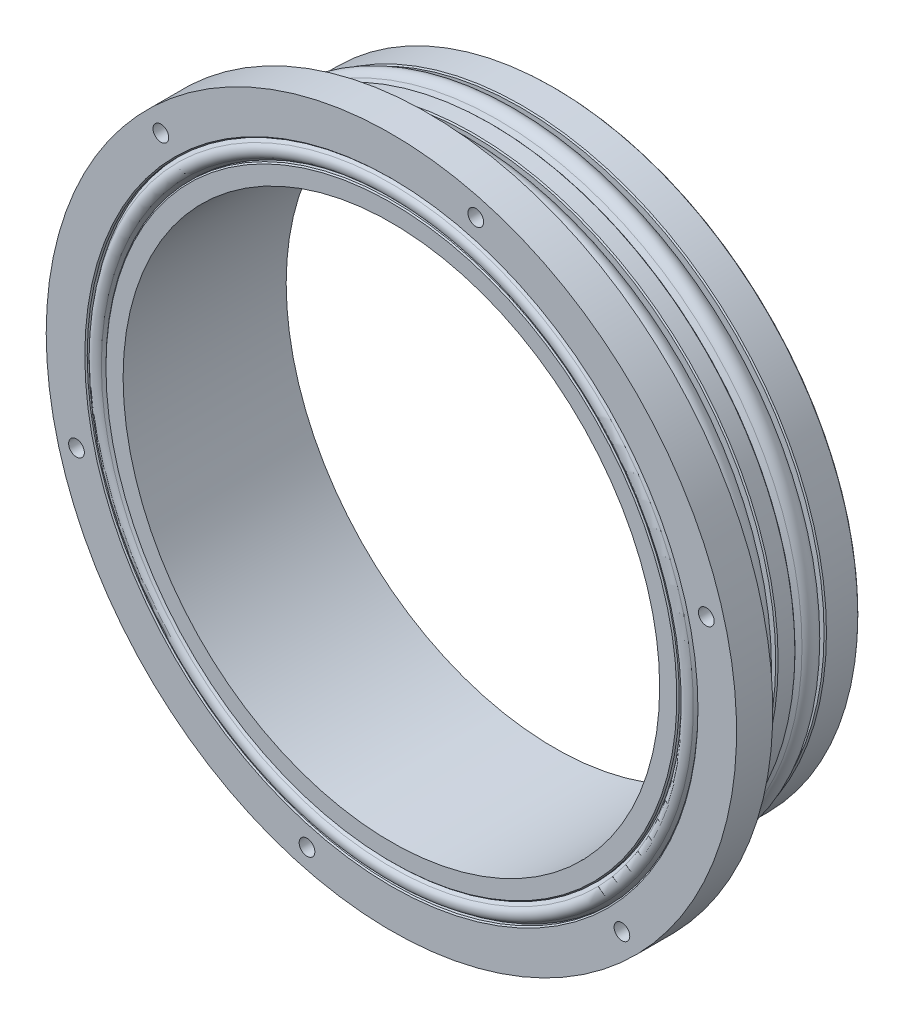
ISO-10303-21;
HEADER;
FILE_DESCRIPTION(('STEP AP214'),'2;1');
FILE_NAME('part.step','',(''),(''),'','','');
FILE_SCHEMA(('AUTOMOTIVE_DESIGN { 1 0 10303 214 1 1 1 1 }'));
ENDSEC;
DATA;
#1=APPLICATION_CONTEXT('core data for automotive mechanical design processes');
#2=APPLICATION_PROTOCOL_DEFINITION('international standard','automotive_design',2000,#1);
#3=PRODUCT_CONTEXT('',#1,'mechanical');
#4=PRODUCT('Part','Part','',(#3));
#5=PRODUCT_RELATED_PRODUCT_CATEGORY('part','',(#4));
#6=PRODUCT_DEFINITION_FORMATION('','',#4);
#7=PRODUCT_DEFINITION_CONTEXT('part definition',#1,'design');
#8=PRODUCT_DEFINITION('design','',#6,#7);
#9=PRODUCT_DEFINITION_SHAPE('','',#8);
#10=(LENGTH_UNIT() NAMED_UNIT(*) SI_UNIT(.MILLI.,.METRE.));
#11=(NAMED_UNIT(*) PLANE_ANGLE_UNIT() SI_UNIT($,.RADIAN.));
#12=(NAMED_UNIT(*) SI_UNIT($,.STERADIAN.) SOLID_ANGLE_UNIT());
#13=UNCERTAINTY_MEASURE_WITH_UNIT(LENGTH_MEASURE(1.E-05),#10,'distance_accuracy_value','');
#14=(GEOMETRIC_REPRESENTATION_CONTEXT(3) GLOBAL_UNCERTAINTY_ASSIGNED_CONTEXT((#13)) GLOBAL_UNIT_ASSIGNED_CONTEXT((#10,
#11,#12)) REPRESENTATION_CONTEXT('',''));
#15=CARTESIAN_POINT('',(0.,0.,0.));
#16=DIRECTION('',(0.,0.,1.));
#17=DIRECTION('',(1.,0.,0.));
#18=AXIS2_PLACEMENT_3D('',#15,#16,#17);
#19=CARTESIAN_POINT('',(0.,0.,0.));
#20=DIRECTION('',(0.,0.,-1.));
#21=DIRECTION('',(-1.,0.,0.));
#22=AXIS2_PLACEMENT_3D('',#19,#20,#21);
#23=PLANE('',#22);
#24=CARTESIAN_POINT('',(0.,0.,0.));
#25=DIRECTION('',(0.,0.,-1.));
#26=DIRECTION('',(-1.,0.,0.));
#27=AXIS2_PLACEMENT_3D('',#24,#25,#26);
#28=CIRCLE('',#27,50.219);
#29=CARTESIAN_POINT('',(-50.219,0.,0.));
#30=VERTEX_POINT('',#29);
#31=EDGE_CURVE('E50',#30,#30,#28,.T.);
#32=ORIENTED_EDGE('',*,*,#31,.T.);
#33=EDGE_LOOP('',(#32));
#34=FACE_BOUND('',#33,.T.);
#35=CARTESIAN_POINT('',(33.2269476479559,-33.2269476479558,0.));
#36=DIRECTION('',(0.,0.,-1.));
#37=DIRECTION('',(0.,1.,0.));
#38=AXIS2_PLACEMENT_3D('',#35,#36,#37);
#39=CIRCLE('',#38,1.29999999999999);
#40=CARTESIAN_POINT('',(33.2269476479559,-31.9269476479559,0.));
#41=VERTEX_POINT('',#40);
#42=EDGE_CURVE('E133',#41,#41,#39,.T.);
#43=ORIENTED_EDGE('',*,*,#42,.F.);
#44=EDGE_LOOP('',(#43));
#45=FACE_BOUND('',#44,.T.);
#46=CARTESIAN_POINT('',(-33.2269476479558,-33.2269476479559,0.));
#47=DIRECTION('',(0.,0.,-1.));
#48=DIRECTION('',(0.,1.,0.));
#49=AXIS2_PLACEMENT_3D('',#46,#47,#48);
#50=CIRCLE('',#49,1.29999999999999);
#51=CARTESIAN_POINT('',(-33.2269476479558,-31.9269476479559,0.));
#52=VERTEX_POINT('',#51);
#53=EDGE_CURVE('E139',#52,#52,#50,.T.);
#54=ORIENTED_EDGE('',*,*,#53,.F.);
#55=EDGE_LOOP('',(#54));
#56=FACE_BOUND('',#55,.T.);
#57=CARTESIAN_POINT('',(-33.2269476479559,33.2269476479558,0.));
#58=DIRECTION('',(0.,0.,-1.));
#59=DIRECTION('',(0.,1.,0.));
#60=AXIS2_PLACEMENT_3D('',#57,#58,#59);
#61=CIRCLE('',#60,1.29999999999999);
#62=CARTESIAN_POINT('',(-33.2269476479559,34.5269476479558,0.));
#63=VERTEX_POINT('',#62);
#64=EDGE_CURVE('E145',#63,#63,#61,.T.);
#65=ORIENTED_EDGE('',*,*,#64,.F.);
#66=EDGE_LOOP('',(#65));
#67=FACE_BOUND('',#66,.T.);
#68=CARTESIAN_POINT('',(33.2269476479558,33.2269476479559,0.));
#69=DIRECTION('',(0.,0.,-1.));
#70=DIRECTION('',(0.,1.,0.));
#71=AXIS2_PLACEMENT_3D('',#68,#69,#70);
#72=CIRCLE('',#71,1.29999999999999);
#73=CARTESIAN_POINT('',(33.2269476479558,34.5269476479559,0.));
#74=VERTEX_POINT('',#73);
#75=EDGE_CURVE('E151',#74,#74,#72,.T.);
#76=ORIENTED_EDGE('',*,*,#75,.F.);
#77=EDGE_LOOP('',(#76));
#78=FACE_BOUND('',#77,.T.);
#79=CARTESIAN_POINT('',(0.,0.,0.));
#80=DIRECTION('',(0.,0.,1.));
#81=DIRECTION('',(1.,0.,0.));
#82=AXIS2_PLACEMENT_3D('',#79,#80,#81);
#83=CIRCLE('',#82,44.419);
#84=CARTESIAN_POINT('',(44.419,0.,0.));
#85=VERTEX_POINT('',#84);
#86=EDGE_CURVE('E185',#85,#85,#83,.T.);
#87=ORIENTED_EDGE('',*,*,#86,.T.);
#88=EDGE_LOOP('',(#87));
#89=FACE_BOUND('',#88,.T.);
#90=ADVANCED_FACE('F30',(#34,#45,#56,#67,#78,#89),#23,.T.);
#91=CARTESIAN_POINT('',(0.,0.,26.8));
#92=DIRECTION('',(0.,0.,-1.));
#93=DIRECTION('',(-1.,0.,0.));
#94=AXIS2_PLACEMENT_3D('',#91,#92,#93);
#95=CONICAL_SURFACE('',#94,47.4599,0.785398163397405);
#96=CARTESIAN_POINT('',(0.,0.,27.));
#97=DIRECTION('',(0.,0.,-1.));
#98=DIRECTION('',(-1.,0.,0.));
#99=AXIS2_PLACEMENT_3D('',#96,#97,#98);
#100=CIRCLE('',#99,47.2599);
#101=CARTESIAN_POINT('',(-47.2599,0.,27.));
#102=VERTEX_POINT('',#101);
#103=EDGE_CURVE('E127',#102,#102,#100,.T.);
#104=ORIENTED_EDGE('',*,*,#103,.T.);
#105=EDGE_LOOP('',(#104));
#106=FACE_BOUND('',#105,.T.);
#107=CARTESIAN_POINT('',(0.,0.,26.8));
#108=DIRECTION('',(0.,0.,-1.));
#109=DIRECTION('',(-1.,0.,0.));
#110=AXIS2_PLACEMENT_3D('',#107,#108,#109);
#111=CIRCLE('',#110,47.4599);
#112=CARTESIAN_POINT('',(-47.4599,0.,26.8));
#113=VERTEX_POINT('',#112);
#114=EDGE_CURVE('E74',#113,#113,#111,.T.);
#115=ORIENTED_EDGE('',*,*,#114,.F.);
#116=EDGE_LOOP('',(#115));
#117=FACE_BOUND('',#116,.T.);
#118=ADVANCED_FACE('F202',(#106,#117),#95,.T.);
#119=CARTESIAN_POINT('',(0.,0.,27.5266928789603));
#120=DIRECTION('',(0.,0.,-1.));
#121=DIRECTION('',(-1.,0.,0.));
#122=AXIS2_PLACEMENT_3D('',#119,#120,#121);
#123=CYLINDRICAL_SURFACE('',#122,47.4599);
#124=ORIENTED_EDGE('',*,*,#114,.T.);
#125=EDGE_LOOP('',(#124));
#126=FACE_BOUND('',#125,.T.);
#127=CARTESIAN_POINT('',(0.,0.,26.2791702351356));
#128=DIRECTION('',(0.,0.,-1.));
#129=DIRECTION('',(-1.,0.,0.));
#130=AXIS2_PLACEMENT_3D('',#127,#128,#129);
#131=CIRCLE('',#130,47.4599);
#132=CARTESIAN_POINT('',(-47.4599,0.,26.2791702351356));
#133=VERTEX_POINT('',#132);
#134=EDGE_CURVE('E82',#133,#133,#131,.T.);
#135=ORIENTED_EDGE('',*,*,#134,.F.);
#136=EDGE_LOOP('',(#135));
#137=FACE_BOUND('',#136,.T.);
#138=ADVANCED_FACE('F205',(#126,#137),#123,.T.);
#139=CARTESIAN_POINT('',(0.,0.,27.0190146200091));
#140=DIRECTION('',(0.,0.,1.));
#141=DIRECTION('',(1.,0.,0.));
#142=AXIS2_PLACEMENT_3D('',#139,#140,#141);
#143=CONICAL_SURFACE('',#142,48.0048384362623,0.63484269657211);
#144=ORIENTED_EDGE('',*,*,#134,.T.);
#145=EDGE_LOOP('',(#144));
#146=FACE_BOUND('',#145,.T.);
#147=CARTESIAN_POINT('',(0.,0.,27.0190146200091));
#148=DIRECTION('',(0.,0.,-1.));
#149=DIRECTION('',(-1.,0.,0.));
#150=AXIS2_PLACEMENT_3D('',#147,#148,#149);
#151=CIRCLE('',#150,48.0048384362623);
#152=CARTESIAN_POINT('',(-48.0048384362623,0.,27.0190146200091));
#153=VERTEX_POINT('',#152);
#154=EDGE_CURVE('E85',#153,#153,#151,.T.);
#155=ORIENTED_EDGE('',*,*,#154,.F.);
#156=EDGE_LOOP('',(#155));
#157=FACE_BOUND('',#156,.T.);
#158=ADVANCED_FACE('F211',(#146,#157),#143,.F.);
#159=CARTESIAN_POINT('',(0.,0.,26.2791702351357));
#160=DIRECTION('',(0.,0.,-1.));
#161=DIRECTION('',(-1.,0.,0.));
#162=AXIS2_PLACEMENT_3D('',#159,#160,#161);
#163=TOROIDAL_SURFACE('',#162,49.0093,1.24752264382461);
#164=ORIENTED_EDGE('',*,*,#154,.T.);
#165=EDGE_LOOP('',(#164));
#166=FACE_BOUND('',#165,.T.);
#167=CARTESIAN_POINT('',(0.,0.,27.0190146200091));
#168=DIRECTION('',(0.,0.,-1.));
#169=DIRECTION('',(-1.,0.,0.));
#170=AXIS2_PLACEMENT_3D('',#167,#168,#169);
#171=CIRCLE('',#170,50.0137615637377);
#172=CARTESIAN_POINT('',(-50.0137615637377,0.,27.0190146200091));
#173=VERTEX_POINT('',#172);
#174=EDGE_CURVE('E88',#173,#173,#171,.T.);
#175=ORIENTED_EDGE('',*,*,#174,.F.);
#176=EDGE_LOOP('',(#175));
#177=FACE_BOUND('',#176,.T.);
#178=ADVANCED_FACE('F217',(#166,#177),#163,.T.);
#179=CARTESIAN_POINT('',(0.,0.,26.2791702351356));
#180=DIRECTION('',(0.,0.,-1.));
#181=DIRECTION('',(-1.,0.,0.));
#182=AXIS2_PLACEMENT_3D('',#179,#180,#181);
#183=CONICAL_SURFACE('',#182,50.5587,0.6348426965721);
#184=ORIENTED_EDGE('',*,*,#174,.T.);
#185=EDGE_LOOP('',(#184));
#186=FACE_BOUND('',#185,.T.);
#187=CARTESIAN_POINT('',(0.,0.,26.2791702351356));
#188=DIRECTION('',(0.,0.,-1.));
#189=DIRECTION('',(-1.,0.,0.));
#190=AXIS2_PLACEMENT_3D('',#187,#188,#189);
#191=CIRCLE('',#190,50.5587);
#192=CARTESIAN_POINT('',(-50.5587,0.,26.2791702351356));
#193=VERTEX_POINT('',#192);
#194=EDGE_CURVE('E91',#193,#193,#191,.T.);
#195=ORIENTED_EDGE('',*,*,#194,.F.);
#196=EDGE_LOOP('',(#195));
#197=FACE_BOUND('',#196,.T.);
#198=ADVANCED_FACE('F223',(#186,#197),#183,.T.);
#199=CARTESIAN_POINT('',(0.,0.,27.5266928789603));
#200=DIRECTION('',(0.,0.,-1.));
#201=DIRECTION('',(-1.,0.,0.));
#202=AXIS2_PLACEMENT_3D('',#199,#200,#201);
#203=CYLINDRICAL_SURFACE('',#202,50.5587);
#204=CARTESIAN_POINT('',(0.,0.,26.8));
#205=DIRECTION('',(0.,0.,1.));
#206=DIRECTION('',(1.,0.,0.));
#207=AXIS2_PLACEMENT_3D('',#204,#205,#206);
#208=CIRCLE('',#207,50.5587);
#209=CARTESIAN_POINT('',(50.5587,0.,26.8));
#210=VERTEX_POINT('',#209);
#211=EDGE_CURVE('E41',#210,#210,#208,.T.);
#212=ORIENTED_EDGE('',*,*,#211,.T.);
#213=EDGE_LOOP('',(#212));
#214=FACE_BOUND('',#213,.T.);
#215=ORIENTED_EDGE('',*,*,#194,.T.);
#216=EDGE_LOOP('',(#215));
#217=FACE_BOUND('',#216,.T.);
#218=ADVANCED_FACE('F229',(#214,#217),#203,.F.);
#219=CARTESIAN_POINT('',(57.15,0.,27.));
#220=DIRECTION('',(0.,0.,1.));
#221=DIRECTION('',(1.,0.,0.));
#222=AXIS2_PLACEMENT_3D('',#219,#220,#221);
#223=PLANE('',#222);
#224=CARTESIAN_POINT('',(0.,0.,27.));
#225=DIRECTION('',(0.,0.,1.));
#226=DIRECTION('',(1.,0.,0.));
#227=AXIS2_PLACEMENT_3D('',#224,#225,#226);
#228=CIRCLE('',#227,50.7587);
#229=CARTESIAN_POINT('',(50.7587,0.,27.));
#230=VERTEX_POINT('',#229);
#231=EDGE_CURVE('E45',#230,#230,#228,.F.);
#232=ORIENTED_EDGE('',*,*,#231,.T.);
#233=EDGE_LOOP('',(#232));
#234=FACE_BOUND('',#233,.T.);
#235=CARTESIAN_POINT('',(-38.166088514544,38.1660885145439,27.));
#236=DIRECTION('',(0.,0.,1.));
#237=DIRECTION('',(1.,0.,0.));
#238=AXIS2_PLACEMENT_3D('',#235,#236,#237);
#239=CIRCLE('',#238,1.29999999999999);
#240=CARTESIAN_POINT('',(-36.866088514544,38.1660885145439,27.));
#241=VERTEX_POINT('',#240);
#242=EDGE_CURVE('E179',#241,#241,#239,.T.);
#243=ORIENTED_EDGE('',*,*,#242,.F.);
#244=EDGE_LOOP('',(#243));
#245=FACE_BOUND('',#244,.T.);
#246=CARTESIAN_POINT('',(13.9697579594085,52.1358464739525,27.));
#247=DIRECTION('',(0.,0.,1.));
#248=DIRECTION('',(1.,0.,0.));
#249=AXIS2_PLACEMENT_3D('',#246,#247,#248);
#250=CIRCLE('',#249,1.29999999999999);
#251=CARTESIAN_POINT('',(15.2697579594085,52.1358464739525,27.));
#252=VERTEX_POINT('',#251);
#253=EDGE_CURVE('E173',#252,#252,#250,.T.);
#254=ORIENTED_EDGE('',*,*,#253,.F.);
#255=EDGE_LOOP('',(#254));
#256=FACE_BOUND('',#255,.T.);
#257=CARTESIAN_POINT('',(52.1358464739525,13.9697579594086,27.));
#258=DIRECTION('',(0.,0.,1.));
#259=DIRECTION('',(1.,0.,0.));
#260=AXIS2_PLACEMENT_3D('',#257,#258,#259);
#261=CIRCLE('',#260,1.29999999999999);
#262=CARTESIAN_POINT('',(53.4358464739525,13.9697579594086,27.));
#263=VERTEX_POINT('',#262);
#264=EDGE_CURVE('E167',#263,#263,#261,.T.);
#265=ORIENTED_EDGE('',*,*,#264,.F.);
#266=EDGE_LOOP('',(#265));
#267=FACE_BOUND('',#266,.T.);
#268=CARTESIAN_POINT('',(38.166088514544,-38.1660885145439,27.));
#269=DIRECTION('',(0.,0.,1.));
#270=DIRECTION('',(1.,0.,0.));
#271=AXIS2_PLACEMENT_3D('',#268,#269,#270);
#272=CIRCLE('',#271,1.29999999999999);
#273=CARTESIAN_POINT('',(39.4660885145439,-38.1660885145439,27.));
#274=VERTEX_POINT('',#273);
#275=EDGE_CURVE('E75',#274,#274,#272,.T.);
#276=ORIENTED_EDGE('',*,*,#275,.F.);
#277=EDGE_LOOP('',(#276));
#278=FACE_BOUND('',#277,.T.);
#279=CARTESIAN_POINT('',(-13.9697579594085,-52.1358464739525,27.));
#280=DIRECTION('',(0.,0.,1.));
#281=DIRECTION('',(1.,0.,0.));
#282=AXIS2_PLACEMENT_3D('',#279,#280,#281);
#283=CIRCLE('',#282,1.29999999999999);
#284=CARTESIAN_POINT('',(-12.6697579594085,-52.1358464739525,27.));
#285=VERTEX_POINT('',#284);
#286=EDGE_CURVE('E160',#285,#285,#283,.T.);
#287=ORIENTED_EDGE('',*,*,#286,.F.);
#288=EDGE_LOOP('',(#287));
#289=FACE_BOUND('',#288,.T.);
#290=CARTESIAN_POINT('',(-52.1358464739525,-13.9697579594086,27.));
#291=DIRECTION('',(0.,0.,1.));
#292=DIRECTION('',(1.,0.,0.));
#293=AXIS2_PLACEMENT_3D('',#290,#291,#292);
#294=CIRCLE('',#293,1.29999999999999);
#295=CARTESIAN_POINT('',(-50.8358464739525,-13.9697579594086,27.));
#296=VERTEX_POINT('',#295);
#297=EDGE_CURVE('E154',#296,#296,#294,.T.);
#298=ORIENTED_EDGE('',*,*,#297,.F.);
#299=EDGE_LOOP('',(#298));
#300=FACE_BOUND('',#299,.T.);
#301=CARTESIAN_POINT('',(0.,0.,27.));
#302=DIRECTION('',(0.,0.,-1.));
#303=DIRECTION('',(-1.,0.,0.));
#304=AXIS2_PLACEMENT_3D('',#301,#302,#303);
#305=CIRCLE('',#304,57.15);
#306=CARTESIAN_POINT('',(-57.15,0.,27.));
#307=VERTEX_POINT('',#306);
#308=EDGE_CURVE('E94',#307,#307,#305,.T.);
#309=ORIENTED_EDGE('',*,*,#308,.F.);
#310=EDGE_LOOP('',(#309));
#311=FACE_BOUND('',#310,.T.);
#312=ADVANCED_FACE('F234',(#234,#245,#256,#267,#278,#289,#300,#311),#223,.T.);
#313=CARTESIAN_POINT('',(0.,0.,27.5266928789603));
#314=DIRECTION('',(0.,0.,-1.));
#315=DIRECTION('',(-1.,0.,0.));
#316=AXIS2_PLACEMENT_3D('',#313,#314,#315);
#317=CYLINDRICAL_SURFACE('',#316,57.15);
#318=ORIENTED_EDGE('',*,*,#308,.T.);
#319=EDGE_LOOP('',(#318));
#320=FACE_BOUND('',#319,.T.);
#321=CARTESIAN_POINT('',(0.,0.,21.));
#322=DIRECTION('',(0.,0.,-1.));
#323=DIRECTION('',(-1.,0.,0.));
#324=AXIS2_PLACEMENT_3D('',#321,#322,#323);
#325=CIRCLE('',#324,57.15);
#326=CARTESIAN_POINT('',(-57.15,0.,21.));
#327=VERTEX_POINT('',#326);
#328=EDGE_CURVE('E97',#327,#327,#325,.T.);
#329=ORIENTED_EDGE('',*,*,#328,.F.);
#330=EDGE_LOOP('',(#329));
#331=FACE_BOUND('',#330,.T.);
#332=ADVANCED_FACE('F240',(#320,#331),#317,.T.);
#333=CARTESIAN_POINT('',(50.419,0.,21.));
#334=DIRECTION('',(0.,0.,-1.));
#335=DIRECTION('',(-1.,0.,0.));
#336=AXIS2_PLACEMENT_3D('',#333,#334,#335);
#337=PLANE('',#336);
#338=CARTESIAN_POINT('',(-38.166088514544,38.1660885145439,21.));
#339=DIRECTION('',(0.,0.,-1.));
#340=DIRECTION('',(0.,1.,0.));
#341=AXIS2_PLACEMENT_3D('',#338,#339,#340);
#342=CIRCLE('',#341,1.29999999999999);
#343=CARTESIAN_POINT('',(-38.166088514544,39.4660885145439,21.));
#344=VERTEX_POINT('',#343);
#345=EDGE_CURVE('E182',#344,#344,#342,.T.);
#346=ORIENTED_EDGE('',*,*,#345,.F.);
#347=EDGE_LOOP('',(#346));
#348=FACE_BOUND('',#347,.T.);
#349=CARTESIAN_POINT('',(13.9697579594085,52.1358464739525,21.));
#350=DIRECTION('',(0.,0.,-1.));
#351=DIRECTION('',(0.,1.,0.));
#352=AXIS2_PLACEMENT_3D('',#349,#350,#351);
#353=CIRCLE('',#352,1.29999999999999);
#354=CARTESIAN_POINT('',(13.9697579594085,53.4358464739525,21.));
#355=VERTEX_POINT('',#354);
#356=EDGE_CURVE('E176',#355,#355,#353,.T.);
#357=ORIENTED_EDGE('',*,*,#356,.F.);
#358=EDGE_LOOP('',(#357));
#359=FACE_BOUND('',#358,.T.);
#360=CARTESIAN_POINT('',(52.1358464739525,13.9697579594086,21.));
#361=DIRECTION('',(0.,0.,-1.));
#362=DIRECTION('',(0.,1.,0.));
#363=AXIS2_PLACEMENT_3D('',#360,#361,#362);
#364=CIRCLE('',#363,1.29999999999999);
#365=CARTESIAN_POINT('',(52.1358464739525,15.2697579594086,21.));
#366=VERTEX_POINT('',#365);
#367=EDGE_CURVE('E170',#366,#366,#364,.T.);
#368=ORIENTED_EDGE('',*,*,#367,.F.);
#369=EDGE_LOOP('',(#368));
#370=FACE_BOUND('',#369,.T.);
#371=CARTESIAN_POINT('',(38.166088514544,-38.1660885145439,21.));
#372=DIRECTION('',(0.,0.,-1.));
#373=DIRECTION('',(0.,1.,0.));
#374=AXIS2_PLACEMENT_3D('',#371,#372,#373);
#375=CIRCLE('',#374,1.29999999999999);
#376=CARTESIAN_POINT('',(38.166088514544,-36.8660885145439,21.));
#377=VERTEX_POINT('',#376);
#378=EDGE_CURVE('E79',#377,#377,#375,.T.);
#379=ORIENTED_EDGE('',*,*,#378,.F.);
#380=EDGE_LOOP('',(#379));
#381=FACE_BOUND('',#380,.T.);
#382=CARTESIAN_POINT('',(-13.9697579594085,-52.1358464739525,21.));
#383=DIRECTION('',(0.,0.,-1.));
#384=DIRECTION('',(0.,1.,0.));
#385=AXIS2_PLACEMENT_3D('',#382,#383,#384);
#386=CIRCLE('',#385,1.29999999999999);
#387=CARTESIAN_POINT('',(-13.9697579594085,-50.8358464739525,21.));
#388=VERTEX_POINT('',#387);
#389=EDGE_CURVE('E78',#388,#388,#386,.T.);
#390=ORIENTED_EDGE('',*,*,#389,.F.);
#391=EDGE_LOOP('',(#390));
#392=FACE_BOUND('',#391,.T.);
#393=CARTESIAN_POINT('',(-52.1358464739525,-13.9697579594086,21.));
#394=DIRECTION('',(0.,0.,-1.));
#395=DIRECTION('',(0.,1.,0.));
#396=AXIS2_PLACEMENT_3D('',#393,#394,#395);
#397=CIRCLE('',#396,1.29999999999999);
#398=CARTESIAN_POINT('',(-52.1358464739525,-12.6697579594086,21.));
#399=VERTEX_POINT('',#398);
#400=EDGE_CURVE('E157',#399,#399,#397,.T.);
#401=ORIENTED_EDGE('',*,*,#400,.F.);
#402=EDGE_LOOP('',(#401));
#403=FACE_BOUND('',#402,.T.);
#404=ORIENTED_EDGE('',*,*,#328,.T.);
#405=EDGE_LOOP('',(#404));
#406=FACE_BOUND('',#405,.T.);
#407=CARTESIAN_POINT('',(0.,0.,21.));
#408=DIRECTION('',(0.,0.,-1.));
#409=DIRECTION('',(-1.,0.,0.));
#410=AXIS2_PLACEMENT_3D('',#407,#408,#409);
#411=CIRCLE('',#410,50.419);
#412=CARTESIAN_POINT('',(-50.419,0.,21.));
#413=VERTEX_POINT('',#412);
#414=EDGE_CURVE('E100',#413,#413,#411,.T.);
#415=ORIENTED_EDGE('',*,*,#414,.F.);
#416=EDGE_LOOP('',(#415));
#417=FACE_BOUND('',#416,.T.);
#418=ADVANCED_FACE('F300',(#348,#359,#370,#381,#392,#403,#406,#417),#337,.T.);
#419=CARTESIAN_POINT('',(0.,0.,27.5266928789603));
#420=DIRECTION('',(0.,0.,-1.));
#421=DIRECTION('',(-1.,0.,0.));
#422=AXIS2_PLACEMENT_3D('',#419,#420,#421);
#423=CYLINDRICAL_SURFACE('',#422,50.419);
#424=CARTESIAN_POINT('',(0.,0.,18.6129999999999));
#425=DIRECTION('',(0.,0.,-1.));
#426=DIRECTION('',(-1.,0.,0.));
#427=AXIS2_PLACEMENT_3D('',#424,#425,#426);
#428=CIRCLE('',#427,50.419);
#429=CARTESIAN_POINT('',(-50.419,0.,18.6129999999999));
#430=VERTEX_POINT('',#429);
#431=EDGE_CURVE('E10',#430,#430,#428,.F.);
#432=ORIENTED_EDGE('',*,*,#431,.T.);
#433=EDGE_LOOP('',(#432));
#434=FACE_BOUND('',#433,.T.);
#435=ORIENTED_EDGE('',*,*,#414,.T.);
#436=EDGE_LOOP('',(#435));
#437=FACE_BOUND('',#436,.T.);
#438=ADVANCED_FACE('F297',(#434,#437),#423,.T.);
#439=CARTESIAN_POINT('',(49.04105,0.,18.413));
#440=DIRECTION('',(0.,0.,-1.));
#441=DIRECTION('',(-1.,0.,0.));
#442=AXIS2_PLACEMENT_3D('',#439,#440,#441);
#443=PLANE('',#442);
#444=CARTESIAN_POINT('',(0.,0.,18.413));
#445=DIRECTION('',(0.,0.,-1.));
#446=DIRECTION('',(-1.,0.,0.));
#447=AXIS2_PLACEMENT_3D('',#444,#445,#446);
#448=CIRCLE('',#447,50.219);
#449=CARTESIAN_POINT('',(-50.219,0.,18.413));
#450=VERTEX_POINT('',#449);
#451=EDGE_CURVE('E37',#450,#450,#448,.T.);
#452=ORIENTED_EDGE('',*,*,#451,.T.);
#453=EDGE_LOOP('',(#452));
#454=FACE_BOUND('',#453,.T.);
#455=CARTESIAN_POINT('',(0.,0.,18.413));
#456=DIRECTION('',(0.,0.,-1.));
#457=DIRECTION('',(-1.,0.,0.));
#458=AXIS2_PLACEMENT_3D('',#455,#456,#457);
#459=CIRCLE('',#458,49.04105);
#460=CARTESIAN_POINT('',(-49.04105,0.,18.413));
#461=VERTEX_POINT('',#460);
#462=EDGE_CURVE('E103',#461,#461,#459,.T.);
#463=ORIENTED_EDGE('',*,*,#462,.F.);
#464=EDGE_LOOP('',(#463));
#465=FACE_BOUND('',#464,.T.);
#466=ADVANCED_FACE('F293',(#454,#465),#443,.T.);
#467=CARTESIAN_POINT('',(0.,0.,17.4525046448516));
#468=DIRECTION('',(0.,0.,-1.));
#469=DIRECTION('',(-1.,0.,0.));
#470=AXIS2_PLACEMENT_3D('',#467,#468,#469);
#471=CONICAL_SURFACE('',#470,50.4316518859611,0.966336052037741);
#472=ORIENTED_EDGE('',*,*,#462,.T.);
#473=EDGE_LOOP('',(#472));
#474=FACE_BOUND('',#473,.T.);
#475=CARTESIAN_POINT('',(0.,0.,17.4525046448516));
#476=DIRECTION('',(0.,0.,-1.));
#477=DIRECTION('',(-1.,0.,0.));
#478=AXIS2_PLACEMENT_3D('',#475,#476,#477);
#479=CIRCLE('',#478,50.4316518859611);
#480=CARTESIAN_POINT('',(-50.4316518859611,0.,17.4525046448516));
#481=VERTEX_POINT('',#480);
#482=EDGE_CURVE('E106',#481,#481,#479,.T.);
#483=ORIENTED_EDGE('',*,*,#482,.F.);
#484=EDGE_LOOP('',(#483));
#485=FACE_BOUND('',#484,.T.);
#486=ADVANCED_FACE('F289',(#474,#485),#471,.T.);
#487=CARTESIAN_POINT('',(0.,0.,16.));
#488=DIRECTION('',(0.,0.,-1.));
#489=DIRECTION('',(-1.,0.,0.));
#490=AXIS2_PLACEMENT_3D('',#487,#488,#489);
#491=TOROIDAL_SURFACE('',#490,49.4284,1.76530000000002);
#492=ORIENTED_EDGE('',*,*,#482,.T.);
#493=EDGE_LOOP('',(#492));
#494=FACE_BOUND('',#493,.T.);
#495=CARTESIAN_POINT('',(0.,0.,14.5474953551483));
#496=DIRECTION('',(0.,0.,-1.));
#497=DIRECTION('',(-1.,0.,0.));
#498=AXIS2_PLACEMENT_3D('',#495,#496,#497);
#499=CIRCLE('',#498,50.4316518859611);
#500=CARTESIAN_POINT('',(-50.4316518859611,0.,14.5474953551483));
#501=VERTEX_POINT('',#500);
#502=EDGE_CURVE('E109',#501,#501,#499,.T.);
#503=ORIENTED_EDGE('',*,*,#502,.F.);
#504=EDGE_LOOP('',(#503));
#505=FACE_BOUND('',#504,.T.);
#506=ADVANCED_FACE('F285',(#494,#505),#491,.T.);
#507=CARTESIAN_POINT('',(0.,0.,13.587));
#508=DIRECTION('',(0.,0.,1.));
#509=DIRECTION('',(1.,0.,0.));
#510=AXIS2_PLACEMENT_3D('',#507,#508,#509);
#511=CONICAL_SURFACE('',#510,49.0410500000001,0.966336052037724);
#512=ORIENTED_EDGE('',*,*,#502,.T.);
#513=EDGE_LOOP('',(#512));
#514=FACE_BOUND('',#513,.T.);
#515=CARTESIAN_POINT('',(0.,0.,13.587));
#516=DIRECTION('',(0.,0.,-1.));
#517=DIRECTION('',(-1.,0.,0.));
#518=AXIS2_PLACEMENT_3D('',#515,#516,#517);
#519=CIRCLE('',#518,49.0410500000001);
#520=CARTESIAN_POINT('',(-49.0410500000001,0.,13.587));
#521=VERTEX_POINT('',#520);
#522=EDGE_CURVE('E112',#521,#521,#519,.T.);
#523=ORIENTED_EDGE('',*,*,#522,.F.);
#524=EDGE_LOOP('',(#523));
#525=FACE_BOUND('',#524,.T.);
#526=ADVANCED_FACE('F281',(#514,#525),#511,.T.);
#527=CARTESIAN_POINT('',(50.419,0.,13.587));
#528=DIRECTION('',(0.,0.,1.));
#529=DIRECTION('',(1.,0.,0.));
#530=AXIS2_PLACEMENT_3D('',#527,#528,#529);
#531=PLANE('',#530);
#532=CARTESIAN_POINT('',(0.,0.,13.587));
#533=DIRECTION('',(0.,0.,1.));
#534=DIRECTION('',(1.,0.,0.));
#535=AXIS2_PLACEMENT_3D('',#532,#533,#534);
#536=CIRCLE('',#535,50.219);
#537=CARTESIAN_POINT('',(50.219,0.,13.587));
#538=VERTEX_POINT('',#537);
#539=EDGE_CURVE('E56',#538,#538,#536,.T.);
#540=ORIENTED_EDGE('',*,*,#539,.T.);
#541=EDGE_LOOP('',(#540));
#542=FACE_BOUND('',#541,.T.);
#543=ORIENTED_EDGE('',*,*,#522,.T.);
#544=EDGE_LOOP('',(#543));
#545=FACE_BOUND('',#544,.T.);
#546=ADVANCED_FACE('F277',(#542,#545),#531,.T.);
#547=CARTESIAN_POINT('',(0.,0.,27.5266928789603));
#548=DIRECTION('',(0.,0.,-1.));
#549=DIRECTION('',(-1.,0.,0.));
#550=AXIS2_PLACEMENT_3D('',#547,#548,#549);
#551=CYLINDRICAL_SURFACE('',#550,50.419);
#552=CARTESIAN_POINT('',(0.,0.,13.387));
#553=DIRECTION('',(0.,0.,1.));
#554=DIRECTION('',(1.,0.,0.));
#555=AXIS2_PLACEMENT_3D('',#552,#553,#554);
#556=CIRCLE('',#555,50.419);
#557=CARTESIAN_POINT('',(50.419,0.,13.387));
#558=VERTEX_POINT('',#557);
#559=EDGE_CURVE('E59',#558,#558,#556,.F.);
#560=ORIENTED_EDGE('',*,*,#559,.T.);
#561=EDGE_LOOP('',(#560));
#562=FACE_BOUND('',#561,.T.);
#563=CARTESIAN_POINT('',(0.,0.,10.613));
#564=DIRECTION('',(0.,0.,-1.));
#565=DIRECTION('',(-1.,0.,0.));
#566=AXIS2_PLACEMENT_3D('',#563,#564,#565);
#567=CIRCLE('',#566,50.419);
#568=CARTESIAN_POINT('',(-50.419,0.,10.613));
#569=VERTEX_POINT('',#568);
#570=EDGE_CURVE('E62',#569,#569,#567,.F.);
#571=ORIENTED_EDGE('',*,*,#570,.T.);
#572=EDGE_LOOP('',(#571));
#573=FACE_BOUND('',#572,.T.);
#574=ADVANCED_FACE('F273',(#562,#573),#551,.T.);
#575=CARTESIAN_POINT('',(49.04105,0.,10.413));
#576=DIRECTION('',(0.,0.,-1.));
#577=DIRECTION('',(-1.,0.,0.));
#578=AXIS2_PLACEMENT_3D('',#575,#576,#577);
#579=PLANE('',#578);
#580=CARTESIAN_POINT('',(0.,0.,10.413));
#581=DIRECTION('',(0.,0.,-1.));
#582=DIRECTION('',(-1.,0.,0.));
#583=AXIS2_PLACEMENT_3D('',#580,#581,#582);
#584=CIRCLE('',#583,50.2190000000001);
#585=CARTESIAN_POINT('',(-50.2190000000001,0.,10.413));
#586=VERTEX_POINT('',#585);
#587=EDGE_CURVE('E53',#586,#586,#584,.T.);
#588=ORIENTED_EDGE('',*,*,#587,.T.);
#589=EDGE_LOOP('',(#588));
#590=FACE_BOUND('',#589,.T.);
#591=CARTESIAN_POINT('',(0.,0.,10.413));
#592=DIRECTION('',(0.,0.,-1.));
#593=DIRECTION('',(-1.,0.,0.));
#594=AXIS2_PLACEMENT_3D('',#591,#592,#593);
#595=CIRCLE('',#594,49.04105);
#596=CARTESIAN_POINT('',(-49.04105,0.,10.413));
#597=VERTEX_POINT('',#596);
#598=EDGE_CURVE('E115',#597,#597,#595,.T.);
#599=ORIENTED_EDGE('',*,*,#598,.F.);
#600=EDGE_LOOP('',(#599));
#601=FACE_BOUND('',#600,.T.);
#602=ADVANCED_FACE('F269',(#590,#601),#579,.T.);
#603=CARTESIAN_POINT('',(0.,0.,9.45250464485164));
#604=DIRECTION('',(0.,0.,-1.));
#605=DIRECTION('',(-1.,0.,0.));
#606=AXIS2_PLACEMENT_3D('',#603,#604,#605);
#607=CONICAL_SURFACE('',#606,50.4316518859611,0.966336052037741);
#608=ORIENTED_EDGE('',*,*,#598,.T.);
#609=EDGE_LOOP('',(#608));
#610=FACE_BOUND('',#609,.T.);
#611=CARTESIAN_POINT('',(0.,0.,9.45250464485164));
#612=DIRECTION('',(0.,0.,-1.));
#613=DIRECTION('',(-1.,0.,0.));
#614=AXIS2_PLACEMENT_3D('',#611,#612,#613);
#615=CIRCLE('',#614,50.4316518859611);
#616=CARTESIAN_POINT('',(-50.4316518859611,0.,9.45250464485164));
#617=VERTEX_POINT('',#616);
#618=EDGE_CURVE('E118',#617,#617,#615,.T.);
#619=ORIENTED_EDGE('',*,*,#618,.F.);
#620=EDGE_LOOP('',(#619));
#621=FACE_BOUND('',#620,.T.);
#622=ADVANCED_FACE('F265',(#610,#621),#607,.T.);
#623=CARTESIAN_POINT('',(0.,0.,8.));
#624=DIRECTION('',(0.,0.,-1.));
#625=DIRECTION('',(-1.,0.,0.));
#626=AXIS2_PLACEMENT_3D('',#623,#624,#625);
#627=TOROIDAL_SURFACE('',#626,49.4284,1.76530000000002);
#628=ORIENTED_EDGE('',*,*,#618,.T.);
#629=EDGE_LOOP('',(#628));
#630=FACE_BOUND('',#629,.T.);
#631=CARTESIAN_POINT('',(0.,0.,6.54749535514835));
#632=DIRECTION('',(0.,0.,-1.));
#633=DIRECTION('',(-1.,0.,0.));
#634=AXIS2_PLACEMENT_3D('',#631,#632,#633);
#635=CIRCLE('',#634,50.4316518859611);
#636=CARTESIAN_POINT('',(-50.4316518859611,0.,6.54749535514835));
#637=VERTEX_POINT('',#636);
#638=EDGE_CURVE('E121',#637,#637,#635,.T.);
#639=ORIENTED_EDGE('',*,*,#638,.F.);
#640=EDGE_LOOP('',(#639));
#641=FACE_BOUND('',#640,.T.);
#642=ADVANCED_FACE('F261',(#630,#641),#627,.T.);
#643=CARTESIAN_POINT('',(0.,0.,5.58700000000001));
#644=DIRECTION('',(0.,0.,1.));
#645=DIRECTION('',(1.,0.,0.));
#646=AXIS2_PLACEMENT_3D('',#643,#644,#645);
#647=CONICAL_SURFACE('',#646,49.04105,0.966336052037736);
#648=ORIENTED_EDGE('',*,*,#638,.T.);
#649=EDGE_LOOP('',(#648));
#650=FACE_BOUND('',#649,.T.);
#651=CARTESIAN_POINT('',(0.,0.,5.58700000000001));
#652=DIRECTION('',(0.,0.,-1.));
#653=DIRECTION('',(-1.,0.,0.));
#654=AXIS2_PLACEMENT_3D('',#651,#652,#653);
#655=CIRCLE('',#654,49.04105);
#656=CARTESIAN_POINT('',(-49.04105,0.,5.58700000000002));
#657=VERTEX_POINT('',#656);
#658=EDGE_CURVE('E124',#657,#657,#655,.T.);
#659=ORIENTED_EDGE('',*,*,#658,.F.);
#660=EDGE_LOOP('',(#659));
#661=FACE_BOUND('',#660,.T.);
#662=ADVANCED_FACE('F257',(#650,#661),#647,.T.);
#663=CARTESIAN_POINT('',(50.419,0.,5.587));
#664=DIRECTION('',(0.,0.,1.));
#665=DIRECTION('',(1.,0.,0.));
#666=AXIS2_PLACEMENT_3D('',#663,#664,#665);
#667=PLANE('',#666);
#668=CARTESIAN_POINT('',(0.,0.,5.587));
#669=DIRECTION('',(0.,0.,1.));
#670=DIRECTION('',(1.,0.,0.));
#671=AXIS2_PLACEMENT_3D('',#668,#669,#670);
#672=CIRCLE('',#671,50.219);
#673=CARTESIAN_POINT('',(50.219,0.,5.587));
#674=VERTEX_POINT('',#673);
#675=EDGE_CURVE('E65',#674,#674,#672,.T.);
#676=ORIENTED_EDGE('',*,*,#675,.T.);
#677=EDGE_LOOP('',(#676));
#678=FACE_BOUND('',#677,.T.);
#679=ORIENTED_EDGE('',*,*,#658,.T.);
#680=EDGE_LOOP('',(#679));
#681=FACE_BOUND('',#680,.T.);
#682=ADVANCED_FACE('F253',(#678,#681),#667,.T.);
#683=CARTESIAN_POINT('',(0.,0.,27.5266928789603));
#684=DIRECTION('',(0.,0.,-1.));
#685=DIRECTION('',(-1.,0.,0.));
#686=AXIS2_PLACEMENT_3D('',#683,#684,#685);
#687=CYLINDRICAL_SURFACE('',#686,50.419);
#688=CARTESIAN_POINT('',(0.,0.,5.38700000000004));
#689=DIRECTION('',(0.,0.,1.));
#690=DIRECTION('',(0.,-1.,0.));
#691=AXIS2_PLACEMENT_3D('',#688,#689,#690);
#692=CIRCLE('',#691,50.419);
#693=CARTESIAN_POINT('',(0.,-50.419,5.38700000000003));
#694=VERTEX_POINT('',#693);
#695=EDGE_CURVE('E68',#694,#694,#692,.F.);
#696=ORIENTED_EDGE('',*,*,#695,.T.);
#697=EDGE_LOOP('',(#696));
#698=FACE_BOUND('',#697,.T.);
#699=CARTESIAN_POINT('',(0.,0.,0.199999999999936));
#700=DIRECTION('',(0.,0.,-1.));
#701=DIRECTION('',(-1.,0.,0.));
#702=AXIS2_PLACEMENT_3D('',#699,#700,#701);
#703=CIRCLE('',#702,50.419);
#704=CARTESIAN_POINT('',(-50.419,0.,0.199999999999941));
#705=VERTEX_POINT('',#704);
#706=EDGE_CURVE('E71',#705,#705,#703,.F.);
#707=ORIENTED_EDGE('',*,*,#706,.T.);
#708=EDGE_LOOP('',(#707));
#709=FACE_BOUND('',#708,.T.);
#710=ADVANCED_FACE('F198',(#698,#709),#687,.T.);
#711=CARTESIAN_POINT('',(47.2599,0.,27.));
#712=DIRECTION('',(0.,0.,1.));
#713=DIRECTION('',(1.,0.,0.));
#714=AXIS2_PLACEMENT_3D('',#711,#712,#713);
#715=PLANE('',#714);
#716=CARTESIAN_POINT('',(0.,0.,27.));
#717=DIRECTION('',(0.,0.,1.));
#718=DIRECTION('',(1.,0.,0.));
#719=AXIS2_PLACEMENT_3D('',#716,#717,#718);
#720=CIRCLE('',#719,44.419);
#721=CARTESIAN_POINT('',(44.419,0.,27.));
#722=VERTEX_POINT('',#721);
#723=EDGE_CURVE('E188',#722,#722,#720,.T.);
#724=ORIENTED_EDGE('',*,*,#723,.F.);
#725=EDGE_LOOP('',(#724));
#726=FACE_BOUND('',#725,.T.);
#727=ORIENTED_EDGE('',*,*,#103,.F.);
#728=EDGE_LOOP('',(#727));
#729=FACE_BOUND('',#728,.T.);
#730=ADVANCED_FACE('F194',(#726,#729),#715,.T.);
#731=CARTESIAN_POINT('',(33.2269476479559,-33.2269476479558,3.99999999999999));
#732=DIRECTION('',(0.,0.,1.));
#733=DIRECTION('',(0.,-1.,0.));
#734=AXIS2_PLACEMENT_3D('',#731,#732,#733);
#735=PLANE('',#734);
#736=CARTESIAN_POINT('',(33.2269476479559,-33.2269476479558,4.));
#737=DIRECTION('',(0.,0.,-1.));
#738=DIRECTION('',(0.,1.,0.));
#739=AXIS2_PLACEMENT_3D('',#736,#737,#738);
#740=CIRCLE('',#739,1.29999999999999);
#741=CARTESIAN_POINT('',(33.2269476479559,-31.9269476479559,4.));
#742=VERTEX_POINT('',#741);
#743=EDGE_CURVE('E130',#742,#742,#740,.T.);
#744=ORIENTED_EDGE('',*,*,#743,.T.);
#745=EDGE_LOOP('',(#744));
#746=FACE_BOUND('',#745,.T.);
#747=ADVANCED_FACE('F197',(#746),#735,.F.);
#748=CARTESIAN_POINT('',(33.2269476479559,-33.2269476479558,0.));
#749=DIRECTION('',(0.,0.,-1.));
#750=DIRECTION('',(0.,1.,0.));
#751=AXIS2_PLACEMENT_3D('',#748,#749,#750);
#752=CYLINDRICAL_SURFACE('',#751,1.29999999999999);
#753=ORIENTED_EDGE('',*,*,#743,.F.);
#754=EDGE_LOOP('',(#753));
#755=FACE_BOUND('',#754,.T.);
#756=ORIENTED_EDGE('',*,*,#42,.T.);
#757=EDGE_LOOP('',(#756));
#758=FACE_BOUND('',#757,.T.);
#759=ADVANCED_FACE('F390',(#755,#758),#752,.F.);
#760=CARTESIAN_POINT('',(-33.2269476479558,-33.2269476479559,4.));
#761=DIRECTION('',(0.,0.,1.));
#762=DIRECTION('',(0.,-1.,0.));
#763=AXIS2_PLACEMENT_3D('',#760,#761,#762);
#764=PLANE('',#763);
#765=CARTESIAN_POINT('',(-33.2269476479558,-33.2269476479559,4.));
#766=DIRECTION('',(0.,0.,-1.));
#767=DIRECTION('',(0.,1.,0.));
#768=AXIS2_PLACEMENT_3D('',#765,#766,#767);
#769=CIRCLE('',#768,1.29999999999999);
#770=CARTESIAN_POINT('',(-33.2269476479558,-31.9269476479559,4.));
#771=VERTEX_POINT('',#770);
#772=EDGE_CURVE('E136',#771,#771,#769,.T.);
#773=ORIENTED_EDGE('',*,*,#772,.T.);
#774=EDGE_LOOP('',(#773));
#775=FACE_BOUND('',#774,.T.);
#776=ADVANCED_FACE('F397',(#775),#764,.F.);
#777=CARTESIAN_POINT('',(-33.2269476479558,-33.2269476479559,0.));
#778=DIRECTION('',(0.,0.,-1.));
#779=DIRECTION('',(0.,1.,0.));
#780=AXIS2_PLACEMENT_3D('',#777,#778,#779);
#781=CYLINDRICAL_SURFACE('',#780,1.29999999999999);
#782=ORIENTED_EDGE('',*,*,#772,.F.);
#783=EDGE_LOOP('',(#782));
#784=FACE_BOUND('',#783,.T.);
#785=ORIENTED_EDGE('',*,*,#53,.T.);
#786=EDGE_LOOP('',(#785));
#787=FACE_BOUND('',#786,.T.);
#788=ADVANCED_FACE('F405',(#784,#787),#781,.F.);
#789=CARTESIAN_POINT('',(-33.2269476479559,33.2269476479558,4.00000000000001));
#790=DIRECTION('',(0.,0.,1.));
#791=DIRECTION('',(0.,-1.,0.));
#792=AXIS2_PLACEMENT_3D('',#789,#790,#791);
#793=PLANE('',#792);
#794=CARTESIAN_POINT('',(-33.2269476479559,33.2269476479558,4.00000000000001));
#795=DIRECTION('',(0.,0.,-1.));
#796=DIRECTION('',(0.,1.,0.));
#797=AXIS2_PLACEMENT_3D('',#794,#795,#796);
#798=CIRCLE('',#797,1.29999999999999);
#799=CARTESIAN_POINT('',(-33.2269476479559,34.5269476479558,4.00000000000001));
#800=VERTEX_POINT('',#799);
#801=EDGE_CURVE('E142',#800,#800,#798,.T.);
#802=ORIENTED_EDGE('',*,*,#801,.T.);
#803=EDGE_LOOP('',(#802));
#804=FACE_BOUND('',#803,.T.);
#805=ADVANCED_FACE('F413',(#804),#793,.F.);
#806=CARTESIAN_POINT('',(-33.2269476479559,33.2269476479558,0.));
#807=DIRECTION('',(0.,0.,-1.));
#808=DIRECTION('',(0.,1.,0.));
#809=AXIS2_PLACEMENT_3D('',#806,#807,#808);
#810=CYLINDRICAL_SURFACE('',#809,1.29999999999999);
#811=ORIENTED_EDGE('',*,*,#801,.F.);
#812=EDGE_LOOP('',(#811));
#813=FACE_BOUND('',#812,.T.);
#814=ORIENTED_EDGE('',*,*,#64,.T.);
#815=EDGE_LOOP('',(#814));
#816=FACE_BOUND('',#815,.T.);
#817=ADVANCED_FACE('F421',(#813,#816),#810,.F.);
#818=CARTESIAN_POINT('',(33.2269476479558,33.2269476479559,4.));
#819=DIRECTION('',(0.,0.,1.));
#820=DIRECTION('',(0.,-1.,0.));
#821=AXIS2_PLACEMENT_3D('',#818,#819,#820);
#822=PLANE('',#821);
#823=CARTESIAN_POINT('',(33.2269476479558,33.2269476479559,4.));
#824=DIRECTION('',(0.,0.,-1.));
#825=DIRECTION('',(0.,1.,0.));
#826=AXIS2_PLACEMENT_3D('',#823,#824,#825);
#827=CIRCLE('',#826,1.29999999999999);
#828=CARTESIAN_POINT('',(33.2269476479558,34.5269476479559,4.));
#829=VERTEX_POINT('',#828);
#830=EDGE_CURVE('E148',#829,#829,#827,.T.);
#831=ORIENTED_EDGE('',*,*,#830,.T.);
#832=EDGE_LOOP('',(#831));
#833=FACE_BOUND('',#832,.T.);
#834=ADVANCED_FACE('F429',(#833),#822,.F.);
#835=CARTESIAN_POINT('',(33.2269476479558,33.2269476479559,0.));
#836=DIRECTION('',(0.,0.,-1.));
#837=DIRECTION('',(0.,1.,0.));
#838=AXIS2_PLACEMENT_3D('',#835,#836,#837);
#839=CYLINDRICAL_SURFACE('',#838,1.29999999999999);
#840=ORIENTED_EDGE('',*,*,#830,.F.);
#841=EDGE_LOOP('',(#840));
#842=FACE_BOUND('',#841,.T.);
#843=ORIENTED_EDGE('',*,*,#75,.T.);
#844=EDGE_LOOP('',(#843));
#845=FACE_BOUND('',#844,.T.);
#846=ADVANCED_FACE('F437',(#842,#845),#839,.F.);
#847=CARTESIAN_POINT('',(-52.1358464739525,-13.9697579594086,21.));
#848=DIRECTION('',(0.,0.,-1.));
#849=DIRECTION('',(0.,1.,0.));
#850=AXIS2_PLACEMENT_3D('',#847,#848,#849);
#851=CYLINDRICAL_SURFACE('',#850,1.29999999999999);
#852=ORIENTED_EDGE('',*,*,#297,.T.);
#853=EDGE_LOOP('',(#852));
#854=FACE_BOUND('',#853,.T.);
#855=ORIENTED_EDGE('',*,*,#400,.T.);
#856=EDGE_LOOP('',(#855));
#857=FACE_BOUND('',#856,.T.);
#858=ADVANCED_FACE('F444',(#854,#857),#851,.F.);
#859=CARTESIAN_POINT('',(-13.9697579594085,-52.1358464739525,21.));
#860=DIRECTION('',(0.,0.,-1.));
#861=DIRECTION('',(0.,1.,0.));
#862=AXIS2_PLACEMENT_3D('',#859,#860,#861);
#863=CYLINDRICAL_SURFACE('',#862,1.29999999999999);
#864=ORIENTED_EDGE('',*,*,#286,.T.);
#865=EDGE_LOOP('',(#864));
#866=FACE_BOUND('',#865,.T.);
#867=ORIENTED_EDGE('',*,*,#389,.T.);
#868=EDGE_LOOP('',(#867));
#869=FACE_BOUND('',#868,.T.);
#870=ADVANCED_FACE('F451',(#866,#869),#863,.F.);
#871=CARTESIAN_POINT('',(38.166088514544,-38.1660885145439,21.));
#872=DIRECTION('',(0.,0.,-1.));
#873=DIRECTION('',(0.,1.,0.));
#874=AXIS2_PLACEMENT_3D('',#871,#872,#873);
#875=CYLINDRICAL_SURFACE('',#874,1.29999999999999);
#876=ORIENTED_EDGE('',*,*,#275,.T.);
#877=EDGE_LOOP('',(#876));
#878=FACE_BOUND('',#877,.T.);
#879=ORIENTED_EDGE('',*,*,#378,.T.);
#880=EDGE_LOOP('',(#879));
#881=FACE_BOUND('',#880,.T.);
#882=ADVANCED_FACE('F459',(#878,#881),#875,.F.);
#883=CARTESIAN_POINT('',(52.1358464739525,13.9697579594086,21.));
#884=DIRECTION('',(0.,0.,-1.));
#885=DIRECTION('',(0.,1.,0.));
#886=AXIS2_PLACEMENT_3D('',#883,#884,#885);
#887=CYLINDRICAL_SURFACE('',#886,1.29999999999999);
#888=ORIENTED_EDGE('',*,*,#264,.T.);
#889=EDGE_LOOP('',(#888));
#890=FACE_BOUND('',#889,.T.);
#891=ORIENTED_EDGE('',*,*,#367,.T.);
#892=EDGE_LOOP('',(#891));
#893=FACE_BOUND('',#892,.T.);
#894=ADVANCED_FACE('F467',(#890,#893),#887,.F.);
#895=CARTESIAN_POINT('',(13.9697579594085,52.1358464739525,21.));
#896=DIRECTION('',(0.,0.,-1.));
#897=DIRECTION('',(0.,1.,0.));
#898=AXIS2_PLACEMENT_3D('',#895,#896,#897);
#899=CYLINDRICAL_SURFACE('',#898,1.29999999999999);
#900=ORIENTED_EDGE('',*,*,#253,.T.);
#901=EDGE_LOOP('',(#900));
#902=FACE_BOUND('',#901,.T.);
#903=ORIENTED_EDGE('',*,*,#356,.T.);
#904=EDGE_LOOP('',(#903));
#905=FACE_BOUND('',#904,.T.);
#906=ADVANCED_FACE('F475',(#902,#905),#899,.F.);
#907=CARTESIAN_POINT('',(-38.166088514544,38.1660885145439,21.));
#908=DIRECTION('',(0.,0.,-1.));
#909=DIRECTION('',(0.,1.,0.));
#910=AXIS2_PLACEMENT_3D('',#907,#908,#909);
#911=CYLINDRICAL_SURFACE('',#910,1.29999999999999);
#912=ORIENTED_EDGE('',*,*,#242,.T.);
#913=EDGE_LOOP('',(#912));
#914=FACE_BOUND('',#913,.T.);
#915=ORIENTED_EDGE('',*,*,#345,.T.);
#916=EDGE_LOOP('',(#915));
#917=FACE_BOUND('',#916,.T.);
#918=ADVANCED_FACE('F483',(#914,#917),#911,.F.);
#919=CARTESIAN_POINT('',(0.,0.,27.));
#920=DIRECTION('',(0.,0.,1.));
#921=DIRECTION('',(1.,0.,0.));
#922=AXIS2_PLACEMENT_3D('',#919,#920,#921);
#923=CYLINDRICAL_SURFACE('',#922,44.419);
#924=ORIENTED_EDGE('',*,*,#86,.F.);
#925=EDGE_LOOP('',(#924));
#926=FACE_BOUND('',#925,.T.);
#927=ORIENTED_EDGE('',*,*,#723,.T.);
#928=EDGE_LOOP('',(#927));
#929=FACE_BOUND('',#928,.T.);
#930=ADVANCED_FACE('F192',(#926,#929),#923,.F.);
#931=CARTESIAN_POINT('',(0.,0.,5.38700000000004));
#932=DIRECTION('',(0.,0.,-1.));
#933=DIRECTION('',(0.,1.,0.));
#934=AXIS2_PLACEMENT_3D('',#931,#932,#933);
#935=CONICAL_SURFACE('',#934,50.419,0.785398163397448);
#936=ORIENTED_EDGE('',*,*,#675,.F.);
#937=EDGE_LOOP('',(#936));
#938=FACE_BOUND('',#937,.T.);
#939=ORIENTED_EDGE('',*,*,#695,.F.);
#940=EDGE_LOOP('',(#939));
#941=FACE_BOUND('',#940,.T.);
#942=ADVANCED_FACE('F496',(#938,#941),#935,.T.);
#943=CARTESIAN_POINT('',(0.,0.,13.387));
#944=DIRECTION('',(0.,0.,-1.));
#945=DIRECTION('',(-1.,0.,0.));
#946=AXIS2_PLACEMENT_3D('',#943,#944,#945);
#947=CONICAL_SURFACE('',#946,50.419,0.785398163397448);
#948=ORIENTED_EDGE('',*,*,#539,.F.);
#949=EDGE_LOOP('',(#948));
#950=FACE_BOUND('',#949,.T.);
#951=ORIENTED_EDGE('',*,*,#559,.F.);
#952=EDGE_LOOP('',(#951));
#953=FACE_BOUND('',#952,.T.);
#954=ADVANCED_FACE('F503',(#950,#953),#947,.T.);
#955=CARTESIAN_POINT('',(0.,0.,10.413));
#956=DIRECTION('',(0.,0.,1.));
#957=DIRECTION('',(1.,0.,0.));
#958=AXIS2_PLACEMENT_3D('',#955,#956,#957);
#959=CONICAL_SURFACE('',#958,50.2190000000001,0.785398163397448);
#960=ORIENTED_EDGE('',*,*,#570,.F.);
#961=EDGE_LOOP('',(#960));
#962=FACE_BOUND('',#961,.T.);
#963=ORIENTED_EDGE('',*,*,#587,.F.);
#964=EDGE_LOOP('',(#963));
#965=FACE_BOUND('',#964,.T.);
#966=ADVANCED_FACE('F511',(#962,#965),#959,.T.);
#967=CARTESIAN_POINT('',(0.,0.,0.));
#968=DIRECTION('',(0.,0.,1.));
#969=DIRECTION('',(1.,0.,0.));
#970=AXIS2_PLACEMENT_3D('',#967,#968,#969);
#971=CONICAL_SURFACE('',#970,50.219,0.785398163397518);
#972=ORIENTED_EDGE('',*,*,#706,.F.);
#973=EDGE_LOOP('',(#972));
#974=FACE_BOUND('',#973,.T.);
#975=ORIENTED_EDGE('',*,*,#31,.F.);
#976=EDGE_LOOP('',(#975));
#977=FACE_BOUND('',#976,.T.);
#978=ADVANCED_FACE('F519',(#974,#977),#971,.T.);
#979=CARTESIAN_POINT('',(0.,0.,27.));
#980=DIRECTION('',(0.,0.,1.));
#981=DIRECTION('',(1.,0.,0.));
#982=AXIS2_PLACEMENT_3D('',#979,#980,#981);
#983=CONICAL_SURFACE('',#982,50.7587,0.785398163397466);
#984=ORIENTED_EDGE('',*,*,#211,.F.);
#985=EDGE_LOOP('',(#984));
#986=FACE_BOUND('',#985,.T.);
#987=ORIENTED_EDGE('',*,*,#231,.F.);
#988=EDGE_LOOP('',(#987));
#989=FACE_BOUND('',#988,.T.);
#990=ADVANCED_FACE('F527',(#986,#989),#983,.F.);
#991=CARTESIAN_POINT('',(0.,0.,18.413));
#992=DIRECTION('',(0.,0.,1.));
#993=DIRECTION('',(1.,0.,0.));
#994=AXIS2_PLACEMENT_3D('',#991,#992,#993);
#995=CONICAL_SURFACE('',#994,50.219,0.785398163397518);
#996=ORIENTED_EDGE('',*,*,#431,.F.);
#997=EDGE_LOOP('',(#996));
#998=FACE_BOUND('',#997,.T.);
#999=ORIENTED_EDGE('',*,*,#451,.F.);
#1000=EDGE_LOOP('',(#999));
#1001=FACE_BOUND('',#1000,.T.);
#1002=ADVANCED_FACE('F32',(#998,#1001),#995,.T.);
#1003=CLOSED_SHELL('',(#90,#118,#138,#158,#178,#198,#218,#312,#332,#418,#438,#466,#486,#506,
#526,#546,#574,#602,#622,#642,#662,#682,#710,#730,#747,#759,#776,#788,#805,#817,#834,#846,#858,
#870,#882,#894,#906,#918,#930,#942,#954,#966,#978,#990,#1002));
#1004=MANIFOLD_SOLID_BREP('B2',#1003);
#1005=ADVANCED_BREP_SHAPE_REPRESENTATION('',(#18,#1004),#14);
#1006=SHAPE_DEFINITION_REPRESENTATION(#9,#1005);
ENDSEC;
END-ISO-10303-21;
